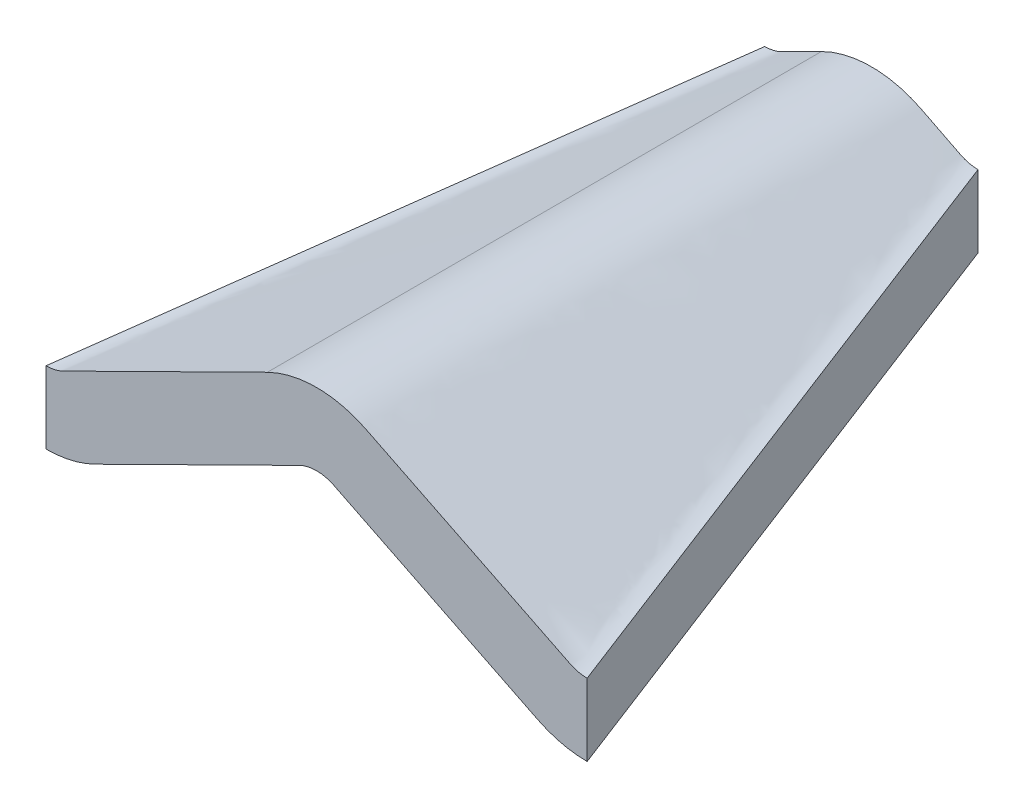
ISO-10303-21;
HEADER;
FILE_DESCRIPTION(('STEP AP214'),'2;1');
FILE_NAME('part.step','',(''),(''),'','','');
FILE_SCHEMA(('AUTOMOTIVE_DESIGN { 1 0 10303 214 1 1 1 1 }'));
ENDSEC;
DATA;
#1=APPLICATION_CONTEXT('core data for automotive mechanical design processes');
#2=APPLICATION_PROTOCOL_DEFINITION('international standard','automotive_design',2000,#1);
#3=PRODUCT_CONTEXT('',#1,'mechanical');
#4=PRODUCT('Part','Part','',(#3));
#5=PRODUCT_RELATED_PRODUCT_CATEGORY('part','',(#4));
#6=PRODUCT_DEFINITION_FORMATION('','',#4);
#7=PRODUCT_DEFINITION_CONTEXT('part definition',#1,'design');
#8=PRODUCT_DEFINITION('design','',#6,#7);
#9=PRODUCT_DEFINITION_SHAPE('','',#8);
#10=(LENGTH_UNIT() NAMED_UNIT(*) SI_UNIT(.MILLI.,.METRE.));
#11=(NAMED_UNIT(*) PLANE_ANGLE_UNIT() SI_UNIT($,.RADIAN.));
#12=(NAMED_UNIT(*) SI_UNIT($,.STERADIAN.) SOLID_ANGLE_UNIT());
#13=UNCERTAINTY_MEASURE_WITH_UNIT(LENGTH_MEASURE(1.E-05),#10,'distance_accuracy_value','');
#14=(GEOMETRIC_REPRESENTATION_CONTEXT(3) GLOBAL_UNCERTAINTY_ASSIGNED_CONTEXT((#13)) GLOBAL_UNIT_ASSIGNED_CONTEXT((#10,
#11,#12)) REPRESENTATION_CONTEXT('',''));
#15=CARTESIAN_POINT('',(0.,0.,0.));
#16=DIRECTION('',(0.,0.,1.));
#17=DIRECTION('',(1.,0.,0.));
#18=AXIS2_PLACEMENT_3D('',#15,#16,#17);
#19=CARTESIAN_POINT('',(1.9171331755426,2.58351259196714,15.));
#20=DIRECTION('',(0.,0.,1.));
#21=DIRECTION('',(1.,0.,0.));
#22=AXIS2_PLACEMENT_3D('',#19,#20,#21);
#23=PLANE('',#22);
#24=DIRECTION('',(0.892798203500015,-0.450456843467989,0.));
#25=VECTOR('',#24,1.);
#26=CARTESIAN_POINT('',(0.896739488724945,2.32250950143665,15.));
#27=LINE('',#26,#25);
#28=CARTESIAN_POINT('',(0.896739488724931,2.32250950143662,15.));
#29=VERTEX_POINT('',#28);
#30=CARTESIAN_POINT('',(1.60511685110653,1.96510126585592,15.));
#31=VERTEX_POINT('',#30);
#32=EDGE_CURVE('E349',#29,#31,#27,.T.);
#33=ORIENTED_EDGE('',*,*,#32,.T.);
#34=CARTESIAN_POINT('',(1.9171331755426,2.58351259196714,15.));
#35=DIRECTION('',(0.,0.,1.));
#36=DIRECTION('',(1.,0.,0.));
#37=AXIS2_PLACEMENT_3D('',#34,#35,#36);
#38=CIRCLE('',#37,0.692666409592125);
#39=CARTESIAN_POINT('',(1.9171331755426,1.89084618237502,15.));
#40=VERTEX_POINT('',#39);
#41=EDGE_CURVE('E389',#31,#40,#38,.T.);
#42=ORIENTED_EDGE('',*,*,#41,.T.);
#43=DIRECTION('',(0.,-1.,0.));
#44=VECTOR('',#43,1.);
#45=CARTESIAN_POINT('',(1.9171331755426,1.89084618237502,15.));
#46=LINE('',#45,#44);
#47=CARTESIAN_POINT('',(1.9171331755426,0.590846182375019,15.));
#48=VERTEX_POINT('',#47);
#49=EDGE_CURVE('E392',#40,#48,#46,.T.);
#50=ORIENTED_EDGE('',*,*,#49,.T.);
#51=CARTESIAN_POINT('',(1.9171331755426,2.58351259196714,15.));
#52=DIRECTION('',(0.,0.,1.));
#53=DIRECTION('',(1.,0.,0.));
#54=AXIS2_PLACEMENT_3D('',#51,#52,#53);
#55=CIRCLE('',#54,1.99266640959212);
#56=CARTESIAN_POINT('',(1.01952295460744,0.804463601301207,15.));
#57=VERTEX_POINT('',#56);
#58=EDGE_CURVE('E396',#57,#48,#55,.T.);
#59=ORIENTED_EDGE('',*,*,#58,.F.);
#60=DIRECTION('',(0.892798203500016,-0.450456843467989,0.));
#61=VECTOR('',#60,1.);
#62=CARTESIAN_POINT('',(0.31114559221656,1.16187183688663,15.));
#63=LINE('',#62,#61);
#64=CARTESIAN_POINT('',(0.311145592219003,1.16187183688536,15.));
#65=VERTEX_POINT('',#64);
#66=EDGE_CURVE('E738',#65,#57,#63,.T.);
#67=ORIENTED_EDGE('',*,*,#66,.F.);
#68=CARTESIAN_POINT('',(-0.00417419821106726,0.536913094436546,15.));
#69=DIRECTION('',(0.,0.,1.));
#70=DIRECTION('',(1.,0.,0.));
#71=AXIS2_PLACEMENT_3D('',#68,#69,#70);
#72=CIRCLE('',#71,0.700000000000046);
#73=CARTESIAN_POINT('',(-0.319493988633977,1.16187183688897,15.));
#74=VERTEX_POINT('',#73);
#75=EDGE_CURVE('E729',#65,#74,#72,.T.);
#76=ORIENTED_EDGE('',*,*,#75,.T.);
#77=DIRECTION('',(-0.892798203499999,-0.450456843468023,0.));
#78=VECTOR('',#77,1.);
#79=CARTESIAN_POINT('',(-0.31949398863869,1.16187183688656,15.));
#80=LINE('',#79,#78);
#81=CARTESIAN_POINT('',(-1.02787135101517,0.804463601308369,15.));
#82=VERTEX_POINT('',#81);
#83=EDGE_CURVE('E721',#74,#82,#80,.T.);
#84=ORIENTED_EDGE('',*,*,#83,.T.);
#85=CARTESIAN_POINT('',(-1.92548157196465,2.58351259196707,15.));
#86=DIRECTION('',(0.,0.,-1.));
#87=DIRECTION('',(-1.,0.,0.));
#88=AXIS2_PLACEMENT_3D('',#85,#86,#87);
#89=CIRCLE('',#88,1.99266640959211);
#90=CARTESIAN_POINT('',(-1.92548157196329,0.590846182374956,15.));
#91=VERTEX_POINT('',#90);
#92=EDGE_CURVE('E543',#82,#91,#89,.T.);
#93=ORIENTED_EDGE('',*,*,#92,.T.);
#94=DIRECTION('',(0.,-1.,0.));
#95=VECTOR('',#94,1.);
#96=CARTESIAN_POINT('',(-1.92548157196329,1.89084618237493,15.));
#97=LINE('',#96,#95);
#98=CARTESIAN_POINT('',(-1.92548157196329,1.89084618237493,15.));
#99=VERTEX_POINT('',#98);
#100=EDGE_CURVE('E557',#99,#91,#97,.T.);
#101=ORIENTED_EDGE('',*,*,#100,.F.);
#102=CARTESIAN_POINT('',(-1.92548157196467,2.58351259196709,15.));
#103=DIRECTION('',(0.,0.,-1.));
#104=DIRECTION('',(-1.,0.,0.));
#105=AXIS2_PLACEMENT_3D('',#102,#103,#104);
#106=CIRCLE('',#105,0.692666409592159);
#107=CARTESIAN_POINT('',(-1.61346524752493,1.96510126585767,15.));
#108=VERTEX_POINT('',#107);
#109=EDGE_CURVE('E357',#108,#99,#106,.T.);
#110=ORIENTED_EDGE('',*,*,#109,.F.);
#111=DIRECTION('',(-0.892798203499988,-0.450456843468045,0.));
#112=VECTOR('',#111,1.);
#113=CARTESIAN_POINT('',(-0.905087885147165,2.32250950143653,15.));
#114=LINE('',#113,#112);
#115=CARTESIAN_POINT('',(-0.905087885147179,2.32250950143656,15.));
#116=VERTEX_POINT('',#115);
#117=EDGE_CURVE('E339',#116,#108,#114,.T.);
#118=ORIENTED_EDGE('',*,*,#117,.F.);
#119=CARTESIAN_POINT('',(-0.00417419821106726,0.536913094436546,15.));
#120=DIRECTION('',(0.,0.,1.));
#121=DIRECTION('',(1.,0.,0.));
#122=AXIS2_PLACEMENT_3D('',#119,#120,#121);
#123=CIRCLE('',#122,2.00000000000005);
#124=EDGE_CURVE('E332',#29,#116,#123,.T.);
#125=ORIENTED_EDGE('',*,*,#124,.F.);
#126=EDGE_LOOP('',(#33,#42,#50,#59,#67,#76,#84,#93,#101,#110,#118,#125));
#127=FACE_BOUND('',#126,.T.);
#128=ADVANCED_FACE('F243',(#127),#23,.F.);
#129=CARTESIAN_POINT('',(-4.875,1.13441258875683,25.));
#130=DIRECTION('',(0.,0.,-1.));
#131=DIRECTION('',(-1.,0.,0.));
#132=AXIS2_PLACEMENT_3D('',#129,#130,#131);
#133=PLANE('',#132);
#134=CARTESIAN_POINT('',(-4.875,1.13441258875683,25.));
#135=DIRECTION('',(0.,0.,-1.));
#136=DIRECTION('',(-1.,0.,0.));
#137=AXIS2_PLACEMENT_3D('',#134,#135,#136);
#138=CIRCLE('',#137,0.699999999999999);
#139=CARTESIAN_POINT('',(-4.56452356675487,0.507033608873553,25.));
#140=VERTEX_POINT('',#139);
#141=CARTESIAN_POINT('',(-4.875,0.434412588756827,25.));
#142=VERTEX_POINT('',#141);
#143=EDGE_CURVE('E429',#140,#142,#138,.T.);
#144=ORIENTED_EDGE('',*,*,#143,.T.);
#145=DIRECTION('',(0.,-1.,0.));
#146=VECTOR('',#145,1.);
#147=CARTESIAN_POINT('',(-4.875,0.434412588756827,25.));
#148=LINE('',#147,#146);
#149=CARTESIAN_POINT('',(-4.875,-0.865587411243173,25.));
#150=VERTEX_POINT('',#149);
#151=EDGE_CURVE('E431',#142,#150,#148,.T.);
#152=ORIENTED_EDGE('',*,*,#151,.T.);
#153=CARTESIAN_POINT('',(-4.875,1.13441258875683,25.));
#154=DIRECTION('',(0.,0.,1.));
#155=DIRECTION('',(-1.,0.,0.));
#156=AXIS2_PLACEMENT_3D('',#153,#154,#155);
#157=CIRCLE('',#156,2.);
#158=CARTESIAN_POINT('',(-3.98792447644969,-0.658098782341817,25.));
#159=VERTEX_POINT('',#158);
#160=EDGE_CURVE('E670',#150,#159,#157,.T.);
#161=ORIENTED_EDGE('',*,*,#160,.T.);
#162=DIRECTION('',(0.896255685547536,0.443537761778765,0.));
#163=VECTOR('',#162,1.);
#164=CARTESIAN_POINT('',(-0.310476433245134,1.1617915686401,25.));
#165=LINE('',#164,#163);
#166=CARTESIAN_POINT('',(-0.310476433243842,1.16179156864074,25.));
#167=VERTEX_POINT('',#166);
#168=EDGE_CURVE('E674',#159,#167,#165,.T.);
#169=ORIENTED_EDGE('',*,*,#168,.T.);
#170=CARTESIAN_POINT('',(0.,0.534412588756827,25.));
#171=DIRECTION('',(0.,0.,-1.));
#172=DIRECTION('',(-1.,0.,0.));
#173=AXIS2_PLACEMENT_3D('',#170,#171,#172);
#174=CIRCLE('',#173,0.7);
#175=CARTESIAN_POINT('',(0.310476433233077,1.16179156864607,25.));
#176=VERTEX_POINT('',#175);
#177=EDGE_CURVE('E829',#167,#176,#174,.T.);
#178=ORIENTED_EDGE('',*,*,#177,.T.);
#179=DIRECTION('',(0.896255685547536,-0.443537761778765,0.));
#180=VECTOR('',#179,1.);
#181=CARTESIAN_POINT('',(0.310476433245135,1.1617915686401,25.));
#182=LINE('',#181,#180);
#183=CARTESIAN_POINT('',(3.98792447640605,-0.658098782320223,25.));
#184=VERTEX_POINT('',#183);
#185=EDGE_CURVE('E830',#176,#184,#182,.T.);
#186=ORIENTED_EDGE('',*,*,#185,.T.);
#187=CARTESIAN_POINT('',(4.875,1.13441258875683,25.));
#188=DIRECTION('',(0.,0.,1.));
#189=DIRECTION('',(1.,0.,0.));
#190=AXIS2_PLACEMENT_3D('',#187,#188,#189);
#191=CIRCLE('',#190,2.);
#192=CARTESIAN_POINT('',(4.875,-0.865587411243173,25.));
#193=VERTEX_POINT('',#192);
#194=EDGE_CURVE('E832',#184,#193,#191,.T.);
#195=ORIENTED_EDGE('',*,*,#194,.T.);
#196=DIRECTION('',(0.,1.,0.));
#197=VECTOR('',#196,1.);
#198=CARTESIAN_POINT('',(4.875,0.434412588756827,25.));
#199=LINE('',#198,#197);
#200=CARTESIAN_POINT('',(4.875,0.434412588756828,25.));
#201=VERTEX_POINT('',#200);
#202=EDGE_CURVE('E441',#193,#201,#199,.T.);
#203=ORIENTED_EDGE('',*,*,#202,.T.);
#204=CARTESIAN_POINT('',(4.875,1.13441258875683,25.));
#205=DIRECTION('',(0.,0.,-1.));
#206=DIRECTION('',(1.,0.,0.));
#207=AXIS2_PLACEMENT_3D('',#204,#205,#206);
#208=CIRCLE('',#207,0.699999999999999);
#209=CARTESIAN_POINT('',(4.56452356673771,0.507033608882039,25.));
#210=VERTEX_POINT('',#209);
#211=EDGE_CURVE('E427',#201,#210,#208,.T.);
#212=ORIENTED_EDGE('',*,*,#211,.T.);
#213=DIRECTION('',(-0.896255685547536,0.443537761778764,0.));
#214=VECTOR('',#213,1.);
#215=CARTESIAN_POINT('',(0.887075523557529,2.3269239598519,25.));
#216=LINE('',#215,#214);
#217=CARTESIAN_POINT('',(0.887075523532766,2.32692395986415,25.));
#218=VERTEX_POINT('',#217);
#219=EDGE_CURVE('E841',#210,#218,#216,.T.);
#220=ORIENTED_EDGE('',*,*,#219,.T.);
#221=CARTESIAN_POINT('',(0.,0.534412588756827,25.));
#222=DIRECTION('',(0.,0.,1.));
#223=DIRECTION('',(-1.,0.,0.));
#224=AXIS2_PLACEMENT_3D('',#221,#222,#223);
#225=CIRCLE('',#224,2.);
#226=CARTESIAN_POINT('',(-0.887075523557528,2.3269239598519,25.));
#227=VERTEX_POINT('',#226);
#228=EDGE_CURVE('E254',#218,#227,#225,.T.);
#229=ORIENTED_EDGE('',*,*,#228,.T.);
#230=DIRECTION('',(-0.896255685547536,-0.443537761778764,0.));
#231=VECTOR('',#230,1.);
#232=CARTESIAN_POINT('',(-0.887075523557528,2.3269239598519,25.));
#233=LINE('',#232,#231);
#234=EDGE_CURVE('E12',#227,#140,#233,.T.);
#235=ORIENTED_EDGE('',*,*,#234,.T.);
#236=EDGE_LOOP('',(#144,#152,#161,#169,#178,#186,#195,#203,#212,#220,#229,#235));
#237=FACE_BOUND('',#236,.T.);
#238=ADVANCED_FACE('F596',(#237),#133,.F.);
#239=CARTESIAN_POINT('',(-0.887075523557529,2.3269239598519,25.));
#240=CARTESIAN_POINT('',(-0.905087885147179,2.32250950143656,15.));
#241=CARTESIAN_POINT('',(-0.749637865049372,2.39493891632225,25.));
#242=CARTESIAN_POINT('',(-0.766093253608779,2.39263854374012,15.));
#243=CARTESIAN_POINT('',(-0.551154061360385,2.46500692076145,25.));
#244=CARTESIAN_POINT('',(-0.521326460236904,2.48457675232231,15.));
#245=CARTESIAN_POINT('',(-0.28448368978903,2.51768256941274,25.));
#246=CARTESIAN_POINT('',(-0.164172275660473,2.53572980873355,15.));
#247=CARTESIAN_POINT('',(-0.0816140386048068,2.53625313385723,25.));
#248=CARTESIAN_POINT('',(0.0995745687535173,2.54001999324865,15.));
#249=CARTESIAN_POINT('',(0.128636514310593,2.53398277500805,25.));
#250=CARTESIAN_POINT('',(0.339684595090544,2.51187657302626,15.));
#251=CARTESIAN_POINT('',(0.349063647157969,2.50857514767088,25.));
#252=CARTESIAN_POINT('',(0.553784737172637,2.46088373580851,15.));
#253=CARTESIAN_POINT('',(0.59117116840835,2.45056687043495,25.));
#254=CARTESIAN_POINT('',(0.739501928821831,2.39662566933751,15.));
#255=CARTESIAN_POINT('',(0.775001880033885,2.38238680801503,25.));
#256=CARTESIAN_POINT('',(0.846708328178838,2.34775247187079,15.));
#257=CARTESIAN_POINT('',(1.10667131254471,2.21825070252811,25.));
#258=CARTESIAN_POINT('',(0.994769960591319,2.2730487198765,15.));
#259=CARTESIAN_POINT('',(1.59392177360361,1.97712087494804,25.));
#260=CARTESIAN_POINT('',(1.10842976458277,2.21570223739651,15.));
#261=CARTESIAN_POINT('',(2.54097422923216,1.50844487854424,25.0000000000001));
#262=CARTESIAN_POINT('',(1.27178738987528,2.13328096912198,15.));
#263=CARTESIAN_POINT('',(3.64783301565559,0.960684148373257,25.));
#264=CARTESIAN_POINT('',(1.42179098781604,2.05759740818701,15.));
#265=CARTESIAN_POINT('',(4.28382109634825,0.645947255344716,25.));
#266=CARTESIAN_POINT('',(1.5345230587371,2.00071900876188,15.));
#267=CARTESIAN_POINT('',(4.6143006868653,0.482399977201709,25.));
#268=CARTESIAN_POINT('',(1.6176352862651,1.95878515235504,15.));
#269=CARTESIAN_POINT('',(4.65993216086637,0.468180749032384,25.));
#270=CARTESIAN_POINT('',(1.64787365926413,1.9451937837494,15.));
#271=CARTESIAN_POINT('',(4.73626906726003,0.446194820834886,25.));
#272=CARTESIAN_POINT('',(1.70433778238779,1.92202491044859,15.));
#273=CARTESIAN_POINT('',(4.79981515110766,0.438019752009024,25.));
#274=CARTESIAN_POINT('',(1.81651163127919,1.89457841136975,15.));
#275=CARTESIAN_POINT('',(4.84835916230714,0.434412588756828,25.));
#276=CARTESIAN_POINT('',(1.89008619613564,1.89084618237502,15.));
#277=CARTESIAN_POINT('',(4.875,0.434412588756828,25.));
#278=CARTESIAN_POINT('',(1.9171331755426,1.89084618237502,15.));
#279=B_SPLINE_SURFACE_WITH_KNOTS('',3,1,((#239,#240),(#241,#242),(#243,#244),(#245,#246),(#247,
#248),(#249,#250),(#251,#252),(#253,#254),(#255,#256),(#257,#258),(#259,#260),(#261,#262),(#263,
#264),(#265,#266),(#267,#268),(#269,#270),(#271,#272),(#273,#274),(#275,#276),(#277,#278)),
.UNSPECIFIED.,.F.,.F.,.F.,(4,1,1,1,1,1,1,2,1,1,1,2,1,1,1,4),(2,2),(0.,0.116094191105499,
0.174141286658249,0.232188382210998,0.290235477763748,0.348282573316498,0.406329668869247,
0.464376764421997,0.57811356484362,0.691850365265243,0.805587165686867,0.91932396610849,
0.939492974581367,0.959661983054245,0.979830991527122,1.),(0.,1.),.UNSPECIFIED.);
#280=DIRECTION('',(-0.280912619729516,0.138319471607858,-0.949713548313818));
#281=VECTOR('',#280,1.);
#282=CARTESIAN_POINT('',(3.3960665877713,1.16262938556592,20.));
#283=LINE('',#282,#281);
#284=EDGE_CURVE('E344',#201,#40,#283,.T.);
#285=DIRECTION('',(0.00180123306145377,0.000441445082397576,0.99999828034137));
#286=VECTOR('',#285,1.);
#287=CARTESIAN_POINT('',(-0.896081704352354,2.32471673064423,20.));
#288=LINE('',#287,#286);
#289=EDGE_CURVE('E337',#116,#227,#288,.T.);
#290=ORIENTED_EDGE('',*,*,#228,.F.);
#291=ORIENTED_EDGE('',*,*,#219,.F.);
#292=ORIENTED_EDGE('',*,*,#211,.F.);
#293=ORIENTED_EDGE('',*,*,#284,.T.);
#294=ORIENTED_EDGE('',*,*,#41,.F.);
#295=ORIENTED_EDGE('',*,*,#32,.F.);
#296=ORIENTED_EDGE('',*,*,#124,.T.);
#297=ORIENTED_EDGE('',*,*,#289,.T.);
#298=EDGE_LOOP('',(#290,#291,#292,#293,#294,#295,#296,#297));
#299=FACE_BOUND('',#298,.T.);
#300=ADVANCED_FACE('F348',(#299),#279,.T.);
#301=CARTESIAN_POINT('',(4.875,0.434412588756828,25.));
#302=DIRECTION('',(0.958931117006445,0.,-0.283639053793323));
#303=DIRECTION('',(0.,-1.,0.));
#304=AXIS2_PLACEMENT_3D('',#301,#302,#303);
#305=PLANE('',#304);
#306=ORIENTED_EDGE('',*,*,#202,.F.);
#307=DIRECTION('',(-0.280912619729516,0.138319471607858,-0.949713548313818));
#308=VECTOR('',#307,1.);
#309=CARTESIAN_POINT('',(3.3960665877713,-0.137370614434077,20.));
#310=LINE('',#309,#308);
#311=EDGE_CURVE('E345',#193,#48,#310,.T.);
#312=ORIENTED_EDGE('',*,*,#311,.T.);
#313=ORIENTED_EDGE('',*,*,#49,.F.);
#314=ORIENTED_EDGE('',*,*,#284,.F.);
#315=EDGE_LOOP('',(#306,#312,#313,#314));
#316=FACE_BOUND('',#315,.T.);
#317=ADVANCED_FACE('F420',(#316),#305,.T.);
#318=CARTESIAN_POINT('',(-4.875,0.434412588756828,25.));
#319=CARTESIAN_POINT('',(-1.92548157196329,1.89084618237493,15.));
#320=CARTESIAN_POINT('',(-4.81946102723476,0.434412588756828,25.));
#321=CARTESIAN_POINT('',(-1.91145999898684,1.89084618237496,15.));
#322=CARTESIAN_POINT('',(-4.78415922479054,0.44156491874374,25.));
#323=CARTESIAN_POINT('',(-1.8691879662849,1.89168346864884,15.));
#324=CARTESIAN_POINT('',(-4.71485682984122,0.449752965419831,25.));
#325=CARTESIAN_POINT('',(-1.76427293156954,1.90612156250016,15.));
#326=CARTESIAN_POINT('',(-4.64911245644979,0.473152611174578,25.));
#327=CARTESIAN_POINT('',(-1.66410123887363,1.94049095361816,15.));
#328=CARTESIAN_POINT('',(-4.61430068686518,0.482399977201766,25.));
#329=CARTESIAN_POINT('',(-1.62598368268707,1.95878515235499,15.));
#330=CARTESIAN_POINT('',(-4.28382109634813,0.645947255344773,25.));
#331=CARTESIAN_POINT('',(-1.54287145515919,2.00071900876178,15.));
#332=CARTESIAN_POINT('',(-3.6890536092101,0.940284958611695,25.));
#333=CARTESIAN_POINT('',(-1.42320365899528,2.06109679347668,15.));
#334=CARTESIAN_POINT('',(-2.7257995451562,1.41697878436272,25.));
#335=CARTESIAN_POINT('',(-1.25927656633531,2.14380538364748,15.));
#336=CARTESIAN_POINT('',(-1.76254548110229,1.89367261011376,25.));
#337=CARTESIAN_POINT('',(-1.09534947367533,2.22651397381827,15.));
#338=CARTESIAN_POINT('',(-1.16777799396426,2.18801031338068,25.));
#339=CARTESIAN_POINT('',(-0.975681677511428,2.28689175853317,15.));
#340=CARTESIAN_POINT('',(-0.887075523557528,2.3269239598519,25.));
#341=CARTESIAN_POINT('',(-0.905087885147165,2.32250950143653,15.));
#342=B_SPLINE_SURFACE_WITH_KNOTS('',3,1,((#318,#319),(#320,#321),(#322,#323),(#324,#325),(#326,
#327),(#328,#329),(#330,#331),(#332,#333),(#334,#335),(#336,#337),(#338,#339),(#340,#341)),
.UNSPECIFIED.,.F.,.F.,.F.,(4,1,1,1,2,1,1,1,4),(2,2),(0.,0.0376552157059903,0.0753104314119805,
0.112965647117971,0.150620862823961,0.362965647117971,0.57531043141198,0.78765521570599,1.),(0.,
1.),.UNSPECIFIED.);
#343=DIRECTION('',(0.280182083341512,0.138350245460276,-0.949924844266898));
#344=VECTOR('',#343,1.);
#345=CARTESIAN_POINT('',(-3.40024078598165,1.16262938556588,20.));
#346=LINE('',#345,#344);
#347=EDGE_CURVE('E351',#142,#99,#346,.T.);
#348=ORIENTED_EDGE('',*,*,#143,.F.);
#349=ORIENTED_EDGE('',*,*,#234,.F.);
#350=ORIENTED_EDGE('',*,*,#289,.F.);
#351=ORIENTED_EDGE('',*,*,#117,.T.);
#352=ORIENTED_EDGE('',*,*,#109,.T.);
#353=ORIENTED_EDGE('',*,*,#347,.F.);
#354=EDGE_LOOP('',(#348,#349,#350,#351,#352,#353));
#355=FACE_BOUND('',#354,.T.);
#356=ADVANCED_FACE('F338',(#355),#342,.T.);
#357=CARTESIAN_POINT('',(4.875,-0.865587411243172,25.));
#358=CARTESIAN_POINT('',(1.9171331755426,0.590846182375019,15.));
#359=CARTESIAN_POINT('',(4.79840965103454,-0.865587411243172,25.));
#360=CARTESIAN_POINT('',(1.83953925033476,0.590846182375019,15.));
#361=CARTESIAN_POINT('',(4.65952700297482,-0.856280721636073,25.));
#362=CARTESIAN_POINT('',(1.65503209286321,0.600275099635923,15.));
#363=CARTESIAN_POINT('',(4.46916006364343,-0.82869909555056,25.));
#364=CARTESIAN_POINT('',(1.36362846042672,0.663061423228087,15.));
#365=CARTESIAN_POINT('',(4.25844067052765,-0.770404640451352,25.));
#366=CARTESIAN_POINT('',(1.16136086213725,0.73711530456098,15.));
#367=CARTESIAN_POINT('',(4.1144597571127,-0.720718385292543,25.));
#368=CARTESIAN_POINT('',(1.06280593603157,0.782625390704721,15.));
#369=CARTESIAN_POINT('',(3.73936121910778,-0.535090144740237,25.));
#370=CARTESIAN_POINT('',(0.934498771508434,0.84736212527569,15.));
#371=CARTESIAN_POINT('',(3.190099811255,-0.263272426427361,25.));
#372=CARTESIAN_POINT('',(0.818978957908446,0.905647066249207,15.));
#373=CARTESIAN_POINT('',(2.18457110487578,0.234342215268636,25.));
#374=CARTESIAN_POINT('',(0.660951706632029,0.985378921121715,15.));
#375=CARTESIAN_POINT('',(1.15023784053653,0.746211616373842,25.));
#376=CARTESIAN_POINT('',(0.505543209596432,1.06378949671239,15.));
#377=CARTESIAN_POINT('',(0.571669318187035,1.03253279857284,25.));
#378=CARTESIAN_POINT('',(0.390499118069591,1.12183441450643,15.));
#379=CARTESIAN_POINT('',(0.263820286310278,1.18488069746618,25.));
#380=CARTESIAN_POINT('',(0.29697089611754,1.16902360851522,15.));
#381=CARTESIAN_POINT('',(0.208438355529238,1.20339491756447,25.));
#382=CARTESIAN_POINT('',(0.262831734811026,1.18522331912744,15.));
#383=CARTESIAN_POINT('',(0.130819597979833,1.22405001220387,25.));
#384=CARTESIAN_POINT('',(0.191909477432442,1.21031957277391,15.));
#385=CARTESIAN_POINT('',(0.0652469580241246,1.23179755477761,25.));
#386=CARTESIAN_POINT('',(0.0989294965417341,1.23132069981177,15.));
#387=CARTESIAN_POINT('',(0.,1.23593733267914,25.));
#388=CARTESIAN_POINT('',(-0.00457355216613362,1.24082194268356,15.));
#389=CARTESIAN_POINT('',(-0.065246958024122,1.2317975547776,25.));
#390=CARTESIAN_POINT('',(-0.107065012996196,1.23141854383178,15.));
#391=CARTESIAN_POINT('',(-0.130819597979829,1.22405001220387,25.));
#392=CARTESIAN_POINT('',(-0.198946872518317,1.21045410830141,15.));
#393=CARTESIAN_POINT('',(-0.208438355529235,1.20339491756447,25.));
#394=CARTESIAN_POINT('',(-0.270621117302359,1.18527224113743,15.));
#395=CARTESIAN_POINT('',(-0.263820286310275,1.18488069746618,25.));
#396=CARTESIAN_POINT('',(-0.305319292539699,1.16902360851521,15.));
#397=CARTESIAN_POINT('',(-0.571669318187031,1.03253279857284,25.));
#398=CARTESIAN_POINT('',(-0.39884751449171,1.12183441450636,15.));
#399=CARTESIAN_POINT('',(-1.15023784053648,0.746211616373865,25.));
#400=CARTESIAN_POINT('',(-0.513891606018533,1.06378949671233,15.));
#401=CARTESIAN_POINT('',(-2.18457110487554,0.234342215268752,25.));
#402=CARTESIAN_POINT('',(-0.669300103054115,0.985378921121651,15.));
#403=CARTESIAN_POINT('',(-3.19009981125478,-0.263272426427252,25.));
#404=CARTESIAN_POINT('',(-0.827327354330494,0.905647066249156,15.));
#405=CARTESIAN_POINT('',(-3.7393612191077,-0.535090144740201,25.));
#406=CARTESIAN_POINT('',(-0.942847167930466,0.847362125275641,15.));
#407=CARTESIAN_POINT('',(-4.11445975711262,-0.720718385292506,25.));
#408=CARTESIAN_POINT('',(-1.07115433245349,0.782625390704721,15.));
#409=CARTESIAN_POINT('',(-4.25844067052769,-0.770404640451378,25.));
#410=CARTESIAN_POINT('',(-1.16968953256827,0.737143154326515,15.));
#411=CARTESIAN_POINT('',(-4.46916006364351,-0.82869909555057,25.));
#412=CARTESIAN_POINT('',(-1.37223559918278,0.663067072670289,15.));
#413=CARTESIAN_POINT('',(-4.65952700297492,-0.85628072163609,25.));
#414=CARTESIAN_POINT('',(-1.66321751238544,0.600259409275868,15.));
#415=CARTESIAN_POINT('',(-4.79840965103461,-0.865587411243173,25.));
#416=CARTESIAN_POINT('',(-1.84788764675552,0.590846182375009,15.));
#417=CARTESIAN_POINT('',(-4.875,-0.865587411243173,25.));
#418=CARTESIAN_POINT('',(-1.92548157196329,0.590846182374956,15.));
#419=B_SPLINE_SURFACE_WITH_KNOTS('',3,1,((#357,#358),(#359,#360),(#361,#362),(#363,#364),(#365,
#366),(#367,#368),(#369,#370),(#371,#372),(#373,#374),(#375,#376),(#377,#378),(#379,#380),(#381,
#382),(#383,#384),(#385,#386),(#387,#388),(#389,#390),(#391,#392),(#393,#394),(#395,#396),(#397,
#398),(#399,#400),(#401,#402),(#403,#404),(#405,#406),(#407,#408),(#409,#410),(#411,#412),(#413,
#414),(#415,#416),(#417,#418)),.UNSPECIFIED.,.F.,.F.,.F.,(4,1,1,1,2,1,1,1,2,1,1,1,1,1,1,1,2,1,1,
1,2,1,1,1,4),(2,2),(0.,0.0377043139493648,0.0754086278987296,0.113112941848094,
0.150817255797459,0.224882819398307,0.298948382999156,0.373013946600004,0.447079510200852,
0.460309632650659,0.473539755100466,0.486769877550273,0.500000000000081,0.513230122449888,
0.526460244899695,0.539690367349502,0.552920489799309,0.626986053400153,0.701051617000997,
0.775117180601841,0.849182744202685,0.886887058152014,0.924591372101343,0.962295686050671,1.),
(0.,1.),.UNSPECIFIED.);
#420=DIRECTION('',(0.280182083341512,0.138350245460278,-0.949924844266898));
#421=VECTOR('',#420,1.);
#422=CARTESIAN_POINT('',(-3.40024078598165,-0.137370614434108,20.));
#423=LINE('',#422,#421);
#424=EDGE_CURVE('E679',#150,#91,#423,.T.);
#425=ORIENTED_EDGE('',*,*,#194,.F.);
#426=ORIENTED_EDGE('',*,*,#185,.F.);
#427=ORIENTED_EDGE('',*,*,#177,.F.);
#428=ORIENTED_EDGE('',*,*,#168,.F.);
#429=ORIENTED_EDGE('',*,*,#160,.F.);
#430=ORIENTED_EDGE('',*,*,#424,.T.);
#431=ORIENTED_EDGE('',*,*,#92,.F.);
#432=ORIENTED_EDGE('',*,*,#83,.F.);
#433=ORIENTED_EDGE('',*,*,#75,.F.);
#434=ORIENTED_EDGE('',*,*,#66,.T.);
#435=ORIENTED_EDGE('',*,*,#58,.T.);
#436=ORIENTED_EDGE('',*,*,#311,.F.);
#437=EDGE_LOOP('',(#425,#426,#427,#428,#429,#430,#431,#432,#433,#434,#435,#436));
#438=FACE_BOUND('',#437,.T.);
#439=ADVANCED_FACE('F477',(#438),#419,.T.);
#440=CARTESIAN_POINT('',(-4.875,-0.865587411243173,25.));
#441=DIRECTION('',(-0.959148626561733,0.,-0.282902654926993));
#442=DIRECTION('',(0.,1.,0.));
#443=AXIS2_PLACEMENT_3D('',#440,#441,#442);
#444=PLANE('',#443);
#445=ORIENTED_EDGE('',*,*,#151,.F.);
#446=ORIENTED_EDGE('',*,*,#347,.T.);
#447=ORIENTED_EDGE('',*,*,#100,.T.);
#448=ORIENTED_EDGE('',*,*,#424,.F.);
#449=EDGE_LOOP('',(#445,#446,#447,#448));
#450=FACE_BOUND('',#449,.T.);
#451=ADVANCED_FACE('F487',(#450),#444,.T.);
#452=CLOSED_SHELL('',(#128,#238,#300,#317,#356,#439,#451));
#453=MANIFOLD_SOLID_BREP('B2',#452);
#454=ADVANCED_BREP_SHAPE_REPRESENTATION('',(#18,#453),#14);
#455=SHAPE_DEFINITION_REPRESENTATION(#9,#454);
ENDSEC;
END-ISO-10303-21;
